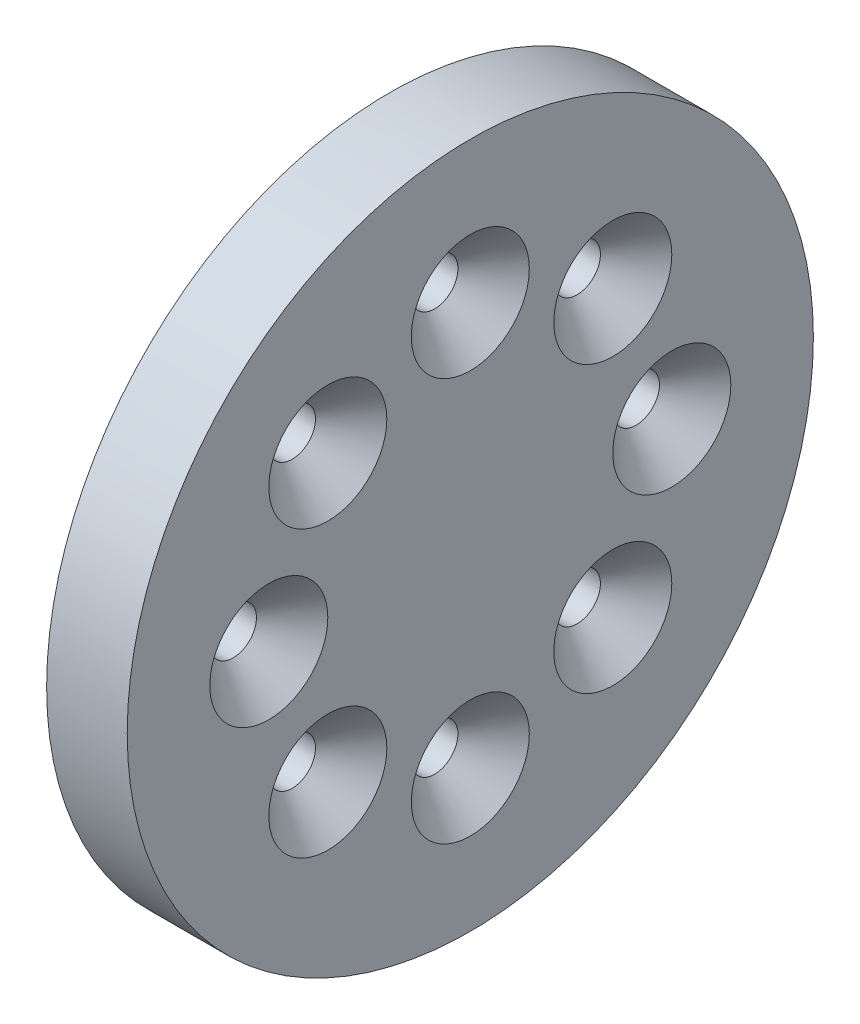
ISO-10303-21;
HEADER;
FILE_DESCRIPTION(('STEP AP214'),'2;1');
FILE_NAME('part.step','',(''),(''),'','','');
FILE_SCHEMA(('AUTOMOTIVE_DESIGN { 1 0 10303 214 1 1 1 1 }'));
ENDSEC;
DATA;
#1=APPLICATION_CONTEXT('core data for automotive mechanical design processes');
#2=APPLICATION_PROTOCOL_DEFINITION('international standard','automotive_design',2000,#1);
#3=PRODUCT_CONTEXT('',#1,'mechanical');
#4=PRODUCT('Part','Part','',(#3));
#5=PRODUCT_RELATED_PRODUCT_CATEGORY('part','',(#4));
#6=PRODUCT_DEFINITION_FORMATION('','',#4);
#7=PRODUCT_DEFINITION_CONTEXT('part definition',#1,'design');
#8=PRODUCT_DEFINITION('design','',#6,#7);
#9=PRODUCT_DEFINITION_SHAPE('','',#8);
#10=(LENGTH_UNIT() NAMED_UNIT(*) SI_UNIT(.MILLI.,.METRE.));
#11=(NAMED_UNIT(*) PLANE_ANGLE_UNIT() SI_UNIT($,.RADIAN.));
#12=(NAMED_UNIT(*) SI_UNIT($,.STERADIAN.) SOLID_ANGLE_UNIT());
#13=UNCERTAINTY_MEASURE_WITH_UNIT(LENGTH_MEASURE(1.E-05),#10,'distance_accuracy_value','');
#14=(GEOMETRIC_REPRESENTATION_CONTEXT(3) GLOBAL_UNCERTAINTY_ASSIGNED_CONTEXT((#13)) GLOBAL_UNIT_ASSIGNED_CONTEXT((#10,
#11,#12)) REPRESENTATION_CONTEXT('',''));
#15=CARTESIAN_POINT('',(0.,0.,0.));
#16=DIRECTION('',(0.,0.,1.));
#17=DIRECTION('',(1.,0.,0.));
#18=AXIS2_PLACEMENT_3D('',#15,#16,#17);
#19=CARTESIAN_POINT('',(0.4,12.3743686707646,-12.3743686707646));
#20=DIRECTION('',(1.,0.,0.));
#21=DIRECTION('',(0.,0.,-1.));
#22=AXIS2_PLACEMENT_3D('',#19,#20,#21);
#23=CONICAL_SURFACE('',#22,2.025,0.785398163397448);
#24=CARTESIAN_POINT('',(0.4,12.3743686707646,-12.3743686707646));
#25=DIRECTION('',(1.,0.,0.));
#26=DIRECTION('',(0.,0.,-1.));
#27=AXIS2_PLACEMENT_3D('',#24,#25,#26);
#28=CIRCLE('',#27,2.025);
#29=CARTESIAN_POINT('',(0.4,12.3743686707646,-14.3993686707646));
#30=VERTEX_POINT('',#29);
#31=EDGE_CURVE('E115',#30,#30,#28,.T.);
#32=ORIENTED_EDGE('',*,*,#31,.F.);
#33=EDGE_LOOP('',(#32));
#34=FACE_BOUND('',#33,.T.);
#35=CARTESIAN_POINT('',(3.5,12.3743686707646,-12.3743686707646));
#36=DIRECTION('',(-1.,0.,0.));
#37=DIRECTION('',(0.,0.,-1.));
#38=AXIS2_PLACEMENT_3D('',#35,#36,#37);
#39=CIRCLE('',#38,5.125);
#40=CARTESIAN_POINT('',(3.5,12.3743686707646,-17.4993686707646));
#41=VERTEX_POINT('',#40);
#42=EDGE_CURVE('E137',#41,#41,#39,.T.);
#43=ORIENTED_EDGE('',*,*,#42,.F.);
#44=EDGE_LOOP('',(#43));
#45=FACE_BOUND('',#44,.T.);
#46=ADVANCED_FACE('F16',(#34,#45),#23,.F.);
#47=CARTESIAN_POINT('',(0.4,0.,-17.5));
#48=DIRECTION('',(1.,0.,0.));
#49=DIRECTION('',(0.,0.,-1.));
#50=AXIS2_PLACEMENT_3D('',#47,#48,#49);
#51=CONICAL_SURFACE('',#50,2.025,0.785398163397448);
#52=CARTESIAN_POINT('',(0.4,0.,-17.5));
#53=DIRECTION('',(1.,0.,0.));
#54=DIRECTION('',(0.,0.,-1.));
#55=AXIS2_PLACEMENT_3D('',#52,#53,#54);
#56=CIRCLE('',#55,2.025);
#57=CARTESIAN_POINT('',(0.4,0.,-19.525));
#58=VERTEX_POINT('',#57);
#59=EDGE_CURVE('E20',#58,#58,#56,.T.);
#60=ORIENTED_EDGE('',*,*,#59,.F.);
#61=EDGE_LOOP('',(#60));
#62=FACE_BOUND('',#61,.T.);
#63=CARTESIAN_POINT('',(3.5,0.,-17.5));
#64=DIRECTION('',(-1.,0.,0.));
#65=DIRECTION('',(0.,0.,-1.));
#66=AXIS2_PLACEMENT_3D('',#63,#64,#65);
#67=CIRCLE('',#66,5.125);
#68=CARTESIAN_POINT('',(3.5,0.,-22.625));
#69=VERTEX_POINT('',#68);
#70=EDGE_CURVE('E141',#69,#69,#67,.T.);
#71=ORIENTED_EDGE('',*,*,#70,.F.);
#72=EDGE_LOOP('',(#71));
#73=FACE_BOUND('',#72,.T.);
#74=ADVANCED_FACE('F215',(#62,#73),#51,.F.);
#75=CARTESIAN_POINT('',(0.4,17.5,0.));
#76=DIRECTION('',(1.,0.,0.));
#77=DIRECTION('',(0.,0.,-1.));
#78=AXIS2_PLACEMENT_3D('',#75,#76,#77);
#79=CONICAL_SURFACE('',#78,2.025,0.785398163397448);
#80=CARTESIAN_POINT('',(0.4,17.5,0.));
#81=DIRECTION('',(1.,0.,0.));
#82=DIRECTION('',(0.,0.,-1.));
#83=AXIS2_PLACEMENT_3D('',#80,#81,#82);
#84=CIRCLE('',#83,2.025);
#85=CARTESIAN_POINT('',(0.4,17.5,-2.025));
#86=VERTEX_POINT('',#85);
#87=EDGE_CURVE('E177',#86,#86,#84,.T.);
#88=ORIENTED_EDGE('',*,*,#87,.F.);
#89=EDGE_LOOP('',(#88));
#90=FACE_BOUND('',#89,.T.);
#91=CARTESIAN_POINT('',(3.5,17.5,0.));
#92=DIRECTION('',(-1.,0.,0.));
#93=DIRECTION('',(0.,0.,-1.));
#94=AXIS2_PLACEMENT_3D('',#91,#92,#93);
#95=CIRCLE('',#94,5.125);
#96=CARTESIAN_POINT('',(3.5,17.5,-5.125));
#97=VERTEX_POINT('',#96);
#98=EDGE_CURVE('E153',#97,#97,#95,.T.);
#99=ORIENTED_EDGE('',*,*,#98,.F.);
#100=EDGE_LOOP('',(#99));
#101=FACE_BOUND('',#100,.T.);
#102=ADVANCED_FACE('F263',(#90,#101),#79,.F.);
#103=CARTESIAN_POINT('',(0.4,0.,17.5));
#104=DIRECTION('',(1.,0.,0.));
#105=DIRECTION('',(0.,0.,-1.));
#106=AXIS2_PLACEMENT_3D('',#103,#104,#105);
#107=CONICAL_SURFACE('',#106,2.025,0.785398163397448);
#108=CARTESIAN_POINT('',(0.4,0.,17.5));
#109=DIRECTION('',(1.,0.,0.));
#110=DIRECTION('',(0.,0.,-1.));
#111=AXIS2_PLACEMENT_3D('',#108,#109,#110);
#112=CIRCLE('',#111,2.025);
#113=CARTESIAN_POINT('',(0.4,0.,15.475));
#114=VERTEX_POINT('',#113);
#115=EDGE_CURVE('E132',#114,#114,#112,.T.);
#116=ORIENTED_EDGE('',*,*,#115,.F.);
#117=EDGE_LOOP('',(#116));
#118=FACE_BOUND('',#117,.T.);
#119=CARTESIAN_POINT('',(3.5,0.,17.5));
#120=DIRECTION('',(-1.,0.,0.));
#121=DIRECTION('',(0.,0.,-1.));
#122=AXIS2_PLACEMENT_3D('',#119,#120,#121);
#123=CIRCLE('',#122,5.125);
#124=CARTESIAN_POINT('',(3.5,0.,12.375));
#125=VERTEX_POINT('',#124);
#126=EDGE_CURVE('E149',#125,#125,#123,.T.);
#127=ORIENTED_EDGE('',*,*,#126,.F.);
#128=EDGE_LOOP('',(#127));
#129=FACE_BOUND('',#128,.T.);
#130=ADVANCED_FACE('F265',(#118,#129),#107,.F.);
#131=CARTESIAN_POINT('',(0.4,-12.3743686707646,-12.3743686707646));
#132=DIRECTION('',(1.,0.,0.));
#133=DIRECTION('',(0.,0.,-1.));
#134=AXIS2_PLACEMENT_3D('',#131,#132,#133);
#135=CONICAL_SURFACE('',#134,2.025,0.785398163397448);
#136=CARTESIAN_POINT('',(0.4,-12.3743686707646,-12.3743686707646));
#137=DIRECTION('',(1.,0.,0.));
#138=DIRECTION('',(0.,0.,-1.));
#139=AXIS2_PLACEMENT_3D('',#136,#137,#138);
#140=CIRCLE('',#139,2.025);
#141=CARTESIAN_POINT('',(0.4,-12.3743686707646,-14.3993686707646));
#142=VERTEX_POINT('',#141);
#143=EDGE_CURVE('E118',#142,#142,#140,.T.);
#144=ORIENTED_EDGE('',*,*,#143,.F.);
#145=EDGE_LOOP('',(#144));
#146=FACE_BOUND('',#145,.T.);
#147=CARTESIAN_POINT('',(3.5,-12.3743686707646,-12.3743686707646));
#148=DIRECTION('',(-1.,0.,0.));
#149=DIRECTION('',(0.,0.,-1.));
#150=AXIS2_PLACEMENT_3D('',#147,#148,#149);
#151=CIRCLE('',#150,5.125);
#152=CARTESIAN_POINT('',(3.5,-12.3743686707646,-17.4993686707646));
#153=VERTEX_POINT('',#152);
#154=EDGE_CURVE('E148',#153,#153,#151,.T.);
#155=ORIENTED_EDGE('',*,*,#154,.F.);
#156=EDGE_LOOP('',(#155));
#157=FACE_BOUND('',#156,.T.);
#158=ADVANCED_FACE('F267',(#146,#157),#135,.F.);
#159=CARTESIAN_POINT('',(0.4,-12.3743686707646,12.3743686707646));
#160=DIRECTION('',(1.,0.,0.));
#161=DIRECTION('',(0.,0.,-1.));
#162=AXIS2_PLACEMENT_3D('',#159,#160,#161);
#163=CONICAL_SURFACE('',#162,2.025,0.785398163397448);
#164=CARTESIAN_POINT('',(0.4,-12.3743686707646,12.3743686707646));
#165=DIRECTION('',(1.,0.,0.));
#166=DIRECTION('',(0.,0.,-1.));
#167=AXIS2_PLACEMENT_3D('',#164,#165,#166);
#168=CIRCLE('',#167,2.025);
#169=CARTESIAN_POINT('',(0.4,-12.3743686707646,10.3493686707646));
#170=VERTEX_POINT('',#169);
#171=EDGE_CURVE('E158',#170,#170,#168,.T.);
#172=ORIENTED_EDGE('',*,*,#171,.F.);
#173=EDGE_LOOP('',(#172));
#174=FACE_BOUND('',#173,.T.);
#175=CARTESIAN_POINT('',(3.5,-12.3743686707646,12.3743686707646));
#176=DIRECTION('',(-1.,0.,0.));
#177=DIRECTION('',(0.,0.,-1.));
#178=AXIS2_PLACEMENT_3D('',#175,#176,#177);
#179=CIRCLE('',#178,5.125);
#180=CARTESIAN_POINT('',(3.5,-12.3743686707646,7.24936867076458));
#181=VERTEX_POINT('',#180);
#182=EDGE_CURVE('E143',#181,#181,#179,.T.);
#183=ORIENTED_EDGE('',*,*,#182,.F.);
#184=EDGE_LOOP('',(#183));
#185=FACE_BOUND('',#184,.T.);
#186=ADVANCED_FACE('F18',(#174,#185),#163,.F.);
#187=CARTESIAN_POINT('',(0.4,-17.5,0.));
#188=DIRECTION('',(1.,0.,0.));
#189=DIRECTION('',(0.,0.,-1.));
#190=AXIS2_PLACEMENT_3D('',#187,#188,#189);
#191=CONICAL_SURFACE('',#190,2.025,0.785398163397448);
#192=CARTESIAN_POINT('',(0.4,-17.5,0.));
#193=DIRECTION('',(1.,0.,0.));
#194=DIRECTION('',(0.,0.,-1.));
#195=AXIS2_PLACEMENT_3D('',#192,#193,#194);
#196=CIRCLE('',#195,2.025);
#197=CARTESIAN_POINT('',(0.4,-17.5,-2.025));
#198=VERTEX_POINT('',#197);
#199=EDGE_CURVE('E166',#198,#198,#196,.T.);
#200=ORIENTED_EDGE('',*,*,#199,.F.);
#201=EDGE_LOOP('',(#200));
#202=FACE_BOUND('',#201,.T.);
#203=CARTESIAN_POINT('',(3.5,-17.5,0.));
#204=DIRECTION('',(-1.,0.,0.));
#205=DIRECTION('',(0.,0.,-1.));
#206=AXIS2_PLACEMENT_3D('',#203,#204,#205);
#207=CIRCLE('',#206,5.125);
#208=CARTESIAN_POINT('',(3.5,-17.5,-5.125));
#209=VERTEX_POINT('',#208);
#210=EDGE_CURVE('E147',#209,#209,#207,.T.);
#211=ORIENTED_EDGE('',*,*,#210,.F.);
#212=EDGE_LOOP('',(#211));
#213=FACE_BOUND('',#212,.T.);
#214=ADVANCED_FACE('F255',(#202,#213),#191,.F.);
#215=CARTESIAN_POINT('',(0.4,12.3743686707646,12.3743686707646));
#216=DIRECTION('',(1.,0.,0.));
#217=DIRECTION('',(0.,0.,-1.));
#218=AXIS2_PLACEMENT_3D('',#215,#216,#217);
#219=CONICAL_SURFACE('',#218,2.025,0.785398163397448);
#220=CARTESIAN_POINT('',(0.4,12.3743686707646,12.3743686707646));
#221=DIRECTION('',(1.,0.,0.));
#222=DIRECTION('',(0.,0.,-1.));
#223=AXIS2_PLACEMENT_3D('',#220,#221,#222);
#224=CIRCLE('',#223,2.025);
#225=CARTESIAN_POINT('',(0.4,12.3743686707646,10.3493686707646));
#226=VERTEX_POINT('',#225);
#227=EDGE_CURVE('E202',#226,#226,#224,.T.);
#228=ORIENTED_EDGE('',*,*,#227,.F.);
#229=EDGE_LOOP('',(#228));
#230=FACE_BOUND('',#229,.T.);
#231=CARTESIAN_POINT('',(3.5,12.3743686707646,12.3743686707646));
#232=DIRECTION('',(-1.,0.,0.));
#233=DIRECTION('',(0.,0.,-1.));
#234=AXIS2_PLACEMENT_3D('',#231,#232,#233);
#235=CIRCLE('',#234,5.125);
#236=CARTESIAN_POINT('',(3.5,12.3743686707646,7.24936867076458));
#237=VERTEX_POINT('',#236);
#238=EDGE_CURVE('E157',#237,#237,#235,.T.);
#239=ORIENTED_EDGE('',*,*,#238,.F.);
#240=EDGE_LOOP('',(#239));
#241=FACE_BOUND('',#240,.T.);
#242=ADVANCED_FACE('F251',(#230,#241),#219,.F.);
#243=CARTESIAN_POINT('',(-2.25,0.,0.));
#244=DIRECTION('',(1.,0.,0.));
#245=DIRECTION('',(0.,1.,0.));
#246=AXIS2_PLACEMENT_3D('',#243,#244,#245);
#247=PLANE('',#246);
#248=CARTESIAN_POINT('',(-2.25,0.,0.));
#249=DIRECTION('',(1.,0.,0.));
#250=DIRECTION('',(0.,0.,-1.));
#251=AXIS2_PLACEMENT_3D('',#248,#249,#250);
#252=CIRCLE('',#251,22.55);
#253=CARTESIAN_POINT('',(-2.25,0.,-22.55));
#254=VERTEX_POINT('',#253);
#255=EDGE_CURVE('E11',#254,#254,#252,.T.);
#256=ORIENTED_EDGE('',*,*,#255,.F.);
#257=EDGE_LOOP('',(#256));
#258=FACE_BOUND('',#257,.T.);
#259=CARTESIAN_POINT('',(-2.25,0.,17.5));
#260=DIRECTION('',(1.,0.,0.));
#261=DIRECTION('',(0.,0.,-1.));
#262=AXIS2_PLACEMENT_3D('',#259,#260,#261);
#263=CIRCLE('',#262,2.025);
#264=CARTESIAN_POINT('',(-2.25,0.,15.475));
#265=VERTEX_POINT('',#264);
#266=EDGE_CURVE('E136',#265,#265,#263,.T.);
#267=ORIENTED_EDGE('',*,*,#266,.T.);
#268=EDGE_LOOP('',(#267));
#269=FACE_BOUND('',#268,.T.);
#270=CARTESIAN_POINT('',(-2.25,-12.3743686707646,12.3743686707646));
#271=DIRECTION('',(1.,0.,0.));
#272=DIRECTION('',(0.,0.,-1.));
#273=AXIS2_PLACEMENT_3D('',#270,#271,#272);
#274=CIRCLE('',#273,2.025);
#275=CARTESIAN_POINT('',(-2.25,-12.3743686707646,10.3493686707646));
#276=VERTEX_POINT('',#275);
#277=EDGE_CURVE('E162',#276,#276,#274,.T.);
#278=ORIENTED_EDGE('',*,*,#277,.T.);
#279=EDGE_LOOP('',(#278));
#280=FACE_BOUND('',#279,.T.);
#281=CARTESIAN_POINT('',(-2.25,-17.5,0.));
#282=DIRECTION('',(1.,0.,0.));
#283=DIRECTION('',(0.,0.,-1.));
#284=AXIS2_PLACEMENT_3D('',#281,#282,#283);
#285=CIRCLE('',#284,2.025);
#286=CARTESIAN_POINT('',(-2.25,-17.5,-2.025));
#287=VERTEX_POINT('',#286);
#288=EDGE_CURVE('E161',#287,#287,#285,.T.);
#289=ORIENTED_EDGE('',*,*,#288,.T.);
#290=EDGE_LOOP('',(#289));
#291=FACE_BOUND('',#290,.T.);
#292=CARTESIAN_POINT('',(-2.25,-12.3743686707646,-12.3743686707646));
#293=DIRECTION('',(1.,0.,0.));
#294=DIRECTION('',(0.,0.,-1.));
#295=AXIS2_PLACEMENT_3D('',#292,#293,#294);
#296=CIRCLE('',#295,2.025);
#297=CARTESIAN_POINT('',(-2.25,-12.3743686707646,-14.3993686707646));
#298=VERTEX_POINT('',#297);
#299=EDGE_CURVE('E126',#298,#298,#296,.T.);
#300=ORIENTED_EDGE('',*,*,#299,.T.);
#301=EDGE_LOOP('',(#300));
#302=FACE_BOUND('',#301,.T.);
#303=CARTESIAN_POINT('',(-2.25,0.,-17.5));
#304=DIRECTION('',(1.,0.,0.));
#305=DIRECTION('',(0.,0.,-1.));
#306=AXIS2_PLACEMENT_3D('',#303,#304,#305);
#307=CIRCLE('',#306,2.025);
#308=CARTESIAN_POINT('',(-2.25,0.,-19.525));
#309=VERTEX_POINT('',#308);
#310=EDGE_CURVE('E109',#309,#309,#307,.T.);
#311=ORIENTED_EDGE('',*,*,#310,.T.);
#312=EDGE_LOOP('',(#311));
#313=FACE_BOUND('',#312,.T.);
#314=CARTESIAN_POINT('',(-2.25,12.3743686707646,-12.3743686707646));
#315=DIRECTION('',(1.,0.,0.));
#316=DIRECTION('',(0.,0.,-1.));
#317=AXIS2_PLACEMENT_3D('',#314,#315,#316);
#318=CIRCLE('',#317,2.025);
#319=CARTESIAN_POINT('',(-2.25,12.3743686707646,-14.3993686707646));
#320=VERTEX_POINT('',#319);
#321=EDGE_CURVE('E99',#320,#320,#318,.T.);
#322=ORIENTED_EDGE('',*,*,#321,.T.);
#323=EDGE_LOOP('',(#322));
#324=FACE_BOUND('',#323,.T.);
#325=CARTESIAN_POINT('',(-2.25,17.5,0.));
#326=DIRECTION('',(1.,0.,0.));
#327=DIRECTION('',(0.,0.,-1.));
#328=AXIS2_PLACEMENT_3D('',#325,#326,#327);
#329=CIRCLE('',#328,2.025);
#330=CARTESIAN_POINT('',(-2.25,17.5,-2.025));
#331=VERTEX_POINT('',#330);
#332=EDGE_CURVE('E173',#331,#331,#329,.T.);
#333=ORIENTED_EDGE('',*,*,#332,.T.);
#334=EDGE_LOOP('',(#333));
#335=FACE_BOUND('',#334,.T.);
#336=CARTESIAN_POINT('',(-2.25,12.3743686707646,12.3743686707646));
#337=DIRECTION('',(1.,0.,0.));
#338=DIRECTION('',(0.,0.,-1.));
#339=AXIS2_PLACEMENT_3D('',#336,#337,#338);
#340=CIRCLE('',#339,2.025);
#341=CARTESIAN_POINT('',(-2.25,12.3743686707646,10.3493686707646));
#342=VERTEX_POINT('',#341);
#343=EDGE_CURVE('E199',#342,#342,#340,.T.);
#344=ORIENTED_EDGE('',*,*,#343,.T.);
#345=EDGE_LOOP('',(#344));
#346=FACE_BOUND('',#345,.T.);
#347=ADVANCED_FACE('F247',(#258,#269,#280,#291,#302,#313,#324,#335,#346),#247,.F.);
#348=CARTESIAN_POINT('',(-2.25,0.,0.));
#349=DIRECTION('',(-1.,0.,0.));
#350=DIRECTION('',(0.,0.,1.));
#351=AXIS2_PLACEMENT_3D('',#348,#349,#350);
#352=CYLINDRICAL_SURFACE('',#351,22.55);
#353=CARTESIAN_POINT('',(-3.5,0.,0.));
#354=DIRECTION('',(1.,0.,0.));
#355=DIRECTION('',(0.,0.,-1.));
#356=AXIS2_PLACEMENT_3D('',#353,#354,#355);
#357=CIRCLE('',#356,22.55);
#358=CARTESIAN_POINT('',(-3.5,0.,-22.55));
#359=VERTEX_POINT('',#358);
#360=EDGE_CURVE('E27',#359,#359,#357,.T.);
#361=ORIENTED_EDGE('',*,*,#360,.F.);
#362=EDGE_LOOP('',(#361));
#363=FACE_BOUND('',#362,.T.);
#364=ORIENTED_EDGE('',*,*,#255,.T.);
#365=EDGE_LOOP('',(#364));
#366=FACE_BOUND('',#365,.T.);
#367=ADVANCED_FACE('F236',(#363,#366),#352,.F.);
#368=CARTESIAN_POINT('',(-3.5,0.,0.));
#369=DIRECTION('',(1.,0.,0.));
#370=DIRECTION('',(0.,1.,0.));
#371=AXIS2_PLACEMENT_3D('',#368,#369,#370);
#372=PLANE('',#371);
#373=CARTESIAN_POINT('',(-3.5,0.,0.));
#374=DIRECTION('',(1.,0.,0.));
#375=DIRECTION('',(0.,0.,-1.));
#376=AXIS2_PLACEMENT_3D('',#373,#374,#375);
#377=CIRCLE('',#376,29.796);
#378=CARTESIAN_POINT('',(-3.5,0.,-29.796));
#379=VERTEX_POINT('',#378);
#380=EDGE_CURVE('E142',#379,#379,#377,.T.);
#381=ORIENTED_EDGE('',*,*,#380,.F.);
#382=EDGE_LOOP('',(#381));
#383=FACE_BOUND('',#382,.T.);
#384=ORIENTED_EDGE('',*,*,#360,.T.);
#385=EDGE_LOOP('',(#384));
#386=FACE_BOUND('',#385,.T.);
#387=ADVANCED_FACE('F226',(#383,#386),#372,.F.);
#388=CARTESIAN_POINT('',(3.5,0.,0.));
#389=DIRECTION('',(1.,0.,0.));
#390=DIRECTION('',(0.,1.,0.));
#391=AXIS2_PLACEMENT_3D('',#388,#389,#390);
#392=PLANE('',#391);
#393=CARTESIAN_POINT('',(3.5,0.,0.));
#394=DIRECTION('',(1.,0.,0.));
#395=DIRECTION('',(0.,0.,-1.));
#396=AXIS2_PLACEMENT_3D('',#393,#394,#395);
#397=CIRCLE('',#396,29.796);
#398=CARTESIAN_POINT('',(3.5,0.,-29.796));
#399=VERTEX_POINT('',#398);
#400=EDGE_CURVE('E130',#399,#399,#397,.T.);
#401=ORIENTED_EDGE('',*,*,#400,.T.);
#402=EDGE_LOOP('',(#401));
#403=FACE_BOUND('',#402,.T.);
#404=ORIENTED_EDGE('',*,*,#238,.T.);
#405=EDGE_LOOP('',(#404));
#406=FACE_BOUND('',#405,.T.);
#407=ORIENTED_EDGE('',*,*,#210,.T.);
#408=EDGE_LOOP('',(#407));
#409=FACE_BOUND('',#408,.T.);
#410=ORIENTED_EDGE('',*,*,#182,.T.);
#411=EDGE_LOOP('',(#410));
#412=FACE_BOUND('',#411,.T.);
#413=ORIENTED_EDGE('',*,*,#154,.T.);
#414=EDGE_LOOP('',(#413));
#415=FACE_BOUND('',#414,.T.);
#416=ORIENTED_EDGE('',*,*,#126,.T.);
#417=EDGE_LOOP('',(#416));
#418=FACE_BOUND('',#417,.T.);
#419=ORIENTED_EDGE('',*,*,#98,.T.);
#420=EDGE_LOOP('',(#419));
#421=FACE_BOUND('',#420,.T.);
#422=ORIENTED_EDGE('',*,*,#70,.T.);
#423=EDGE_LOOP('',(#422));
#424=FACE_BOUND('',#423,.T.);
#425=ORIENTED_EDGE('',*,*,#42,.T.);
#426=EDGE_LOOP('',(#425));
#427=FACE_BOUND('',#426,.T.);
#428=ADVANCED_FACE('F223',(#403,#406,#409,#412,#415,#418,#421,#424,#427),#392,.T.);
#429=CARTESIAN_POINT('',(3.5,0.,0.));
#430=DIRECTION('',(-1.,0.,0.));
#431=DIRECTION('',(0.,0.,1.));
#432=AXIS2_PLACEMENT_3D('',#429,#430,#431);
#433=CYLINDRICAL_SURFACE('',#432,29.796);
#434=ORIENTED_EDGE('',*,*,#380,.T.);
#435=EDGE_LOOP('',(#434));
#436=FACE_BOUND('',#435,.T.);
#437=ORIENTED_EDGE('',*,*,#400,.F.);
#438=EDGE_LOOP('',(#437));
#439=FACE_BOUND('',#438,.T.);
#440=ADVANCED_FACE('F225',(#436,#439),#433,.T.);
#441=CARTESIAN_POINT('',(3.5,0.,17.5));
#442=DIRECTION('',(-1.,0.,0.));
#443=DIRECTION('',(0.,0.,1.));
#444=AXIS2_PLACEMENT_3D('',#441,#442,#443);
#445=CYLINDRICAL_SURFACE('',#444,2.025);
#446=ORIENTED_EDGE('',*,*,#115,.T.);
#447=EDGE_LOOP('',(#446));
#448=FACE_BOUND('',#447,.T.);
#449=ORIENTED_EDGE('',*,*,#266,.F.);
#450=EDGE_LOOP('',(#449));
#451=FACE_BOUND('',#450,.T.);
#452=ADVANCED_FACE('F233',(#448,#451),#445,.F.);
#453=CARTESIAN_POINT('',(3.5,12.3743686707646,12.3743686707646));
#454=DIRECTION('',(-1.,0.,0.));
#455=DIRECTION('',(0.,0.,1.));
#456=AXIS2_PLACEMENT_3D('',#453,#454,#455);
#457=CYLINDRICAL_SURFACE('',#456,2.025);
#458=ORIENTED_EDGE('',*,*,#227,.T.);
#459=EDGE_LOOP('',(#458));
#460=FACE_BOUND('',#459,.T.);
#461=ORIENTED_EDGE('',*,*,#343,.F.);
#462=EDGE_LOOP('',(#461));
#463=FACE_BOUND('',#462,.T.);
#464=ADVANCED_FACE('F284',(#460,#463),#457,.F.);
#465=CARTESIAN_POINT('',(3.5,17.5,0.));
#466=DIRECTION('',(-1.,0.,0.));
#467=DIRECTION('',(0.,0.,1.));
#468=AXIS2_PLACEMENT_3D('',#465,#466,#467);
#469=CYLINDRICAL_SURFACE('',#468,2.025);
#470=ORIENTED_EDGE('',*,*,#87,.T.);
#471=EDGE_LOOP('',(#470));
#472=FACE_BOUND('',#471,.T.);
#473=ORIENTED_EDGE('',*,*,#332,.F.);
#474=EDGE_LOOP('',(#473));
#475=FACE_BOUND('',#474,.T.);
#476=ADVANCED_FACE('F260',(#472,#475),#469,.F.);
#477=CARTESIAN_POINT('',(3.5,12.3743686707646,-12.3743686707646));
#478=DIRECTION('',(-1.,0.,0.));
#479=DIRECTION('',(0.,0.,1.));
#480=AXIS2_PLACEMENT_3D('',#477,#478,#479);
#481=CYLINDRICAL_SURFACE('',#480,2.025);
#482=ORIENTED_EDGE('',*,*,#31,.T.);
#483=EDGE_LOOP('',(#482));
#484=FACE_BOUND('',#483,.T.);
#485=ORIENTED_EDGE('',*,*,#321,.F.);
#486=EDGE_LOOP('',(#485));
#487=FACE_BOUND('',#486,.T.);
#488=ADVANCED_FACE('F210',(#484,#487),#481,.F.);
#489=CARTESIAN_POINT('',(3.5,0.,-17.5));
#490=DIRECTION('',(-1.,0.,0.));
#491=DIRECTION('',(0.,0.,1.));
#492=AXIS2_PLACEMENT_3D('',#489,#490,#491);
#493=CYLINDRICAL_SURFACE('',#492,2.025);
#494=ORIENTED_EDGE('',*,*,#59,.T.);
#495=EDGE_LOOP('',(#494));
#496=FACE_BOUND('',#495,.T.);
#497=ORIENTED_EDGE('',*,*,#310,.F.);
#498=EDGE_LOOP('',(#497));
#499=FACE_BOUND('',#498,.T.);
#500=ADVANCED_FACE('F105',(#496,#499),#493,.F.);
#501=CARTESIAN_POINT('',(3.5,-12.3743686707646,-12.3743686707646));
#502=DIRECTION('',(-1.,0.,0.));
#503=DIRECTION('',(0.,0.,1.));
#504=AXIS2_PLACEMENT_3D('',#501,#502,#503);
#505=CYLINDRICAL_SURFACE('',#504,2.025);
#506=ORIENTED_EDGE('',*,*,#143,.T.);
#507=EDGE_LOOP('',(#506));
#508=FACE_BOUND('',#507,.T.);
#509=ORIENTED_EDGE('',*,*,#299,.F.);
#510=EDGE_LOOP('',(#509));
#511=FACE_BOUND('',#510,.T.);
#512=ADVANCED_FACE('F243',(#508,#511),#505,.F.);
#513=CARTESIAN_POINT('',(3.5,-17.5,0.));
#514=DIRECTION('',(-1.,0.,0.));
#515=DIRECTION('',(0.,0.,1.));
#516=AXIS2_PLACEMENT_3D('',#513,#514,#515);
#517=CYLINDRICAL_SURFACE('',#516,2.025);
#518=ORIENTED_EDGE('',*,*,#199,.T.);
#519=EDGE_LOOP('',(#518));
#520=FACE_BOUND('',#519,.T.);
#521=ORIENTED_EDGE('',*,*,#288,.F.);
#522=EDGE_LOOP('',(#521));
#523=FACE_BOUND('',#522,.T.);
#524=ADVANCED_FACE('F279',(#520,#523),#517,.F.);
#525=CARTESIAN_POINT('',(3.5,-12.3743686707646,12.3743686707646));
#526=DIRECTION('',(-1.,0.,0.));
#527=DIRECTION('',(0.,0.,1.));
#528=AXIS2_PLACEMENT_3D('',#525,#526,#527);
#529=CYLINDRICAL_SURFACE('',#528,2.025);
#530=ORIENTED_EDGE('',*,*,#171,.T.);
#531=EDGE_LOOP('',(#530));
#532=FACE_BOUND('',#531,.T.);
#533=ORIENTED_EDGE('',*,*,#277,.F.);
#534=EDGE_LOOP('',(#533));
#535=FACE_BOUND('',#534,.T.);
#536=ADVANCED_FACE('F276',(#532,#535),#529,.F.);
#537=CLOSED_SHELL('',(#46,#74,#102,#130,#158,#186,#214,#242,#347,#367,#387,#428,#440,#452,#464,
#476,#488,#500,#512,#524,#536));
#538=MANIFOLD_SOLID_BREP('B1',#537);
#539=ADVANCED_BREP_SHAPE_REPRESENTATION('',(#18,#538),#14);
#540=SHAPE_DEFINITION_REPRESENTATION(#9,#539);
ENDSEC;
END-ISO-10303-21;
